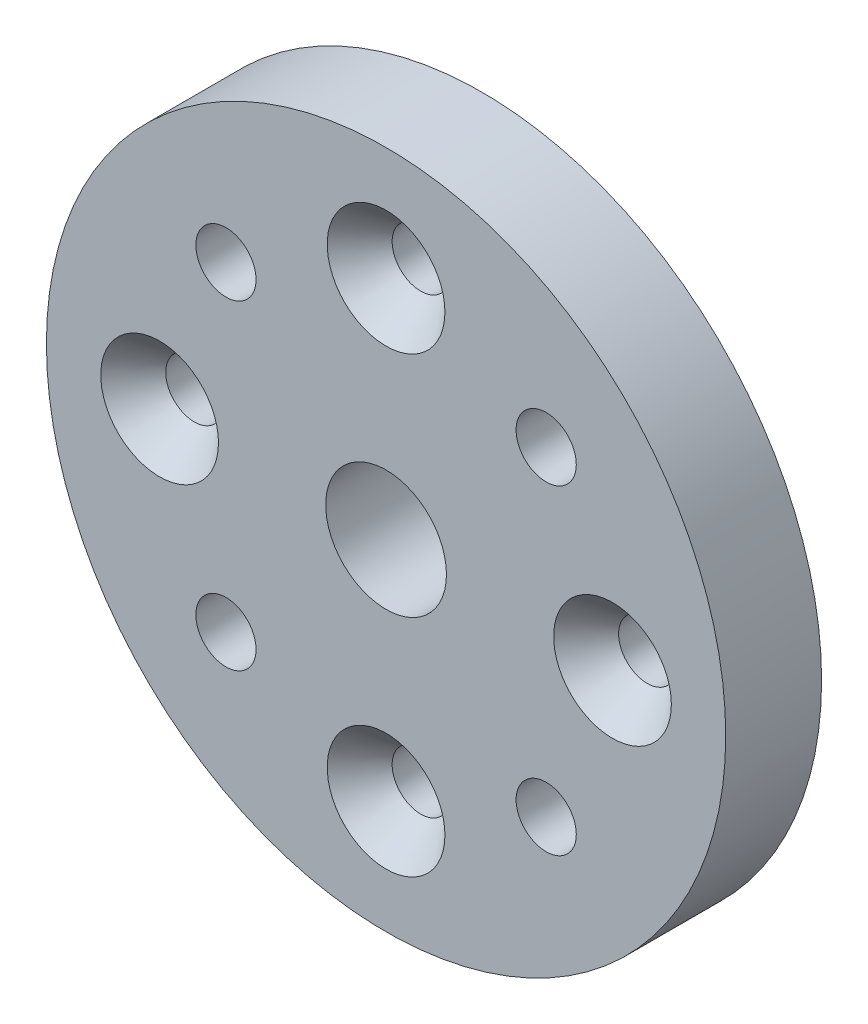
ISO-10303-21;
HEADER;
FILE_DESCRIPTION(('STEP AP214'),'2;1');
FILE_NAME('part.step','',(''),(''),'','','');
FILE_SCHEMA(('AUTOMOTIVE_DESIGN { 1 0 10303 214 1 1 1 1 }'));
ENDSEC;
DATA;
#1=APPLICATION_CONTEXT('core data for automotive mechanical design processes');
#2=APPLICATION_PROTOCOL_DEFINITION('international standard','automotive_design',2000,#1);
#3=PRODUCT_CONTEXT('',#1,'mechanical');
#4=PRODUCT('Part','Part','',(#3));
#5=PRODUCT_RELATED_PRODUCT_CATEGORY('part','',(#4));
#6=PRODUCT_DEFINITION_FORMATION('','',#4);
#7=PRODUCT_DEFINITION_CONTEXT('part definition',#1,'design');
#8=PRODUCT_DEFINITION('design','',#6,#7);
#9=PRODUCT_DEFINITION_SHAPE('','',#8);
#10=(LENGTH_UNIT() NAMED_UNIT(*) SI_UNIT(.MILLI.,.METRE.));
#11=(NAMED_UNIT(*) PLANE_ANGLE_UNIT() SI_UNIT($,.RADIAN.));
#12=(NAMED_UNIT(*) SI_UNIT($,.STERADIAN.) SOLID_ANGLE_UNIT());
#13=UNCERTAINTY_MEASURE_WITH_UNIT(LENGTH_MEASURE(1.E-05),#10,'distance_accuracy_value','');
#14=(GEOMETRIC_REPRESENTATION_CONTEXT(3) GLOBAL_UNCERTAINTY_ASSIGNED_CONTEXT((#13)) GLOBAL_UNIT_ASSIGNED_CONTEXT((#10,
#11,#12)) REPRESENTATION_CONTEXT('',''));
#15=CARTESIAN_POINT('',(0.,0.,0.));
#16=DIRECTION('',(0.,0.,1.));
#17=DIRECTION('',(1.,0.,0.));
#18=AXIS2_PLACEMENT_3D('',#15,#16,#17);
#19=CARTESIAN_POINT('',(0.,0.,6.35));
#20=DIRECTION('',(0.,0.,1.));
#21=DIRECTION('',(1.,0.,0.));
#22=AXIS2_PLACEMENT_3D('',#19,#20,#21);
#23=PLANE('',#22);
#24=CARTESIAN_POINT('',(3.48781665394082E-13,-15.0000000000002,6.35));
#25=DIRECTION('',(0.,0.,1.));
#26=DIRECTION('',(1.,0.,0.));
#27=AXIS2_PLACEMENT_3D('',#24,#25,#26);
#28=CIRCLE('',#27,3.8989000000297);
#29=CARTESIAN_POINT('',(3.89890000003005,-15.0000000000002,6.35));
#30=VERTEX_POINT('',#29);
#31=EDGE_CURVE('E48',#30,#30,#28,.F.);
#32=ORIENTED_EDGE('',*,*,#31,.T.);
#33=EDGE_LOOP('',(#32));
#34=FACE_BOUND('',#33,.T.);
#35=CARTESIAN_POINT('',(-15.,1.57116660247941E-13,6.35));
#36=DIRECTION('',(0.,0.,1.));
#37=DIRECTION('',(1.,0.,0.));
#38=AXIS2_PLACEMENT_3D('',#35,#36,#37);
#39=CIRCLE('',#38,3.8989000000297);
#40=CARTESIAN_POINT('',(-11.1010999999703,1.57116660247941E-13,6.35));
#41=VERTEX_POINT('',#40);
#42=EDGE_CURVE('E53',#41,#41,#39,.F.);
#43=ORIENTED_EDGE('',*,*,#42,.T.);
#44=EDGE_LOOP('',(#43));
#45=FACE_BOUND('',#44,.T.);
#46=CARTESIAN_POINT('',(0.,15.,6.35));
#47=DIRECTION('',(0.,0.,1.));
#48=DIRECTION('',(1.,0.,0.));
#49=AXIS2_PLACEMENT_3D('',#46,#47,#48);
#50=CIRCLE('',#49,3.8989000000297);
#51=CARTESIAN_POINT('',(3.8989000000297,15.,6.35));
#52=VERTEX_POINT('',#51);
#53=EDGE_CURVE('E56',#52,#52,#50,.F.);
#54=ORIENTED_EDGE('',*,*,#53,.T.);
#55=EDGE_LOOP('',(#54));
#56=FACE_BOUND('',#55,.T.);
#57=CARTESIAN_POINT('',(15.,0.,6.35));
#58=DIRECTION('',(0.,0.,1.));
#59=DIRECTION('',(1.,0.,0.));
#60=AXIS2_PLACEMENT_3D('',#57,#58,#59);
#61=CIRCLE('',#60,3.89890000002971);
#62=CARTESIAN_POINT('',(18.8989000000297,0.,6.35));
#63=VERTEX_POINT('',#62);
#64=EDGE_CURVE('E59',#63,#63,#61,.F.);
#65=ORIENTED_EDGE('',*,*,#64,.T.);
#66=EDGE_LOOP('',(#65));
#67=FACE_BOUND('',#66,.T.);
#68=CARTESIAN_POINT('',(0.,0.,6.35));
#69=DIRECTION('',(0.,0.,1.));
#70=DIRECTION('',(1.,0.,0.));
#71=AXIS2_PLACEMENT_3D('',#68,#69,#70);
#72=CIRCLE('',#71,22.5);
#73=CARTESIAN_POINT('',(22.5,0.,6.35));
#74=VERTEX_POINT('',#73);
#75=EDGE_CURVE('E65',#74,#74,#72,.T.);
#76=ORIENTED_EDGE('',*,*,#75,.T.);
#77=EDGE_LOOP('',(#76));
#78=FACE_BOUND('',#77,.T.);
#79=CARTESIAN_POINT('',(0.,0.,6.35));
#80=DIRECTION('',(0.,0.,1.));
#81=DIRECTION('',(1.,0.,0.));
#82=AXIS2_PLACEMENT_3D('',#79,#80,#81);
#83=CIRCLE('',#82,4.);
#84=CARTESIAN_POINT('',(4.,0.,6.35));
#85=VERTEX_POINT('',#84);
#86=EDGE_CURVE('E69',#85,#85,#83,.T.);
#87=ORIENTED_EDGE('',*,*,#86,.F.);
#88=EDGE_LOOP('',(#87));
#89=FACE_BOUND('',#88,.T.);
#90=CARTESIAN_POINT('',(10.6066017177982,10.6066017177982,6.35));
#91=DIRECTION('',(0.,0.,1.));
#92=DIRECTION('',(1.,0.,0.));
#93=AXIS2_PLACEMENT_3D('',#90,#91,#92);
#94=CIRCLE('',#93,1.9939);
#95=CARTESIAN_POINT('',(12.6005017177982,10.6066017177982,6.35));
#96=VERTEX_POINT('',#95);
#97=EDGE_CURVE('E80',#96,#96,#94,.T.);
#98=ORIENTED_EDGE('',*,*,#97,.F.);
#99=EDGE_LOOP('',(#98));
#100=FACE_BOUND('',#99,.T.);
#101=CARTESIAN_POINT('',(10.6066017177982,-10.6066017177983,6.35));
#102=DIRECTION('',(0.,0.,1.));
#103=DIRECTION('',(1.,0.,0.));
#104=AXIS2_PLACEMENT_3D('',#101,#102,#103);
#105=CIRCLE('',#104,1.9939);
#106=CARTESIAN_POINT('',(12.6005017177982,-10.6066017177983,6.35));
#107=VERTEX_POINT('',#106);
#108=EDGE_CURVE('E89',#107,#107,#105,.T.);
#109=ORIENTED_EDGE('',*,*,#108,.F.);
#110=EDGE_LOOP('',(#109));
#111=FACE_BOUND('',#110,.T.);
#112=CARTESIAN_POINT('',(-10.6066017177979,-10.6066017177983,6.35));
#113=DIRECTION('',(0.,0.,1.));
#114=DIRECTION('',(1.,0.,0.));
#115=AXIS2_PLACEMENT_3D('',#112,#113,#114);
#116=CIRCLE('',#115,1.9939);
#117=CARTESIAN_POINT('',(-8.61270171779788,-10.6066017177983,6.35));
#118=VERTEX_POINT('',#117);
#119=EDGE_CURVE('E98',#118,#118,#116,.T.);
#120=ORIENTED_EDGE('',*,*,#119,.F.);
#121=EDGE_LOOP('',(#120));
#122=FACE_BOUND('',#121,.T.);
#123=CARTESIAN_POINT('',(-10.6066017177981,10.6066017177983,6.35));
#124=DIRECTION('',(0.,0.,1.));
#125=DIRECTION('',(1.,0.,0.));
#126=AXIS2_PLACEMENT_3D('',#123,#124,#125);
#127=CIRCLE('',#126,1.9939);
#128=CARTESIAN_POINT('',(-8.61270171779808,10.6066017177983,6.35));
#129=VERTEX_POINT('',#128);
#130=EDGE_CURVE('E107',#129,#129,#127,.T.);
#131=ORIENTED_EDGE('',*,*,#130,.F.);
#132=EDGE_LOOP('',(#131));
#133=FACE_BOUND('',#132,.T.);
#134=ADVANCED_FACE('F33',(#34,#45,#56,#67,#78,#89,#100,#111,#122,#133),#23,.T.);
#135=CARTESIAN_POINT('',(0.,0.,0.));
#136=DIRECTION('',(0.,0.,1.));
#137=DIRECTION('',(1.,0.,0.));
#138=AXIS2_PLACEMENT_3D('',#135,#136,#137);
#139=PLANE('',#138);
#140=CARTESIAN_POINT('',(0.,0.,0.));
#141=DIRECTION('',(0.,0.,1.));
#142=DIRECTION('',(1.,0.,0.));
#143=AXIS2_PLACEMENT_3D('',#140,#141,#142);
#144=CIRCLE('',#143,22.5);
#145=CARTESIAN_POINT('',(22.5,0.,0.));
#146=VERTEX_POINT('',#145);
#147=EDGE_CURVE('E66',#146,#146,#144,.T.);
#148=ORIENTED_EDGE('',*,*,#147,.F.);
#149=EDGE_LOOP('',(#148));
#150=FACE_BOUND('',#149,.T.);
#151=CARTESIAN_POINT('',(0.,0.,0.));
#152=DIRECTION('',(0.,0.,1.));
#153=DIRECTION('',(1.,0.,0.));
#154=AXIS2_PLACEMENT_3D('',#151,#152,#153);
#155=CIRCLE('',#154,4.);
#156=CARTESIAN_POINT('',(4.,0.,0.));
#157=VERTEX_POINT('',#156);
#158=EDGE_CURVE('E72',#157,#157,#155,.T.);
#159=ORIENTED_EDGE('',*,*,#158,.T.);
#160=EDGE_LOOP('',(#159));
#161=FACE_BOUND('',#160,.T.);
#162=CARTESIAN_POINT('',(0.,15.,0.));
#163=DIRECTION('',(0.,0.,1.));
#164=DIRECTION('',(1.,0.,0.));
#165=AXIS2_PLACEMENT_3D('',#162,#163,#164);
#166=CIRCLE('',#165,1.89865);
#167=CARTESIAN_POINT('',(1.89865,15.,0.));
#168=VERTEX_POINT('',#167);
#169=EDGE_CURVE('E75',#168,#168,#166,.T.);
#170=ORIENTED_EDGE('',*,*,#169,.T.);
#171=EDGE_LOOP('',(#170));
#172=FACE_BOUND('',#171,.T.);
#173=CARTESIAN_POINT('',(10.6066017177982,10.6066017177982,0.));
#174=DIRECTION('',(0.,0.,1.));
#175=DIRECTION('',(1.,0.,0.));
#176=AXIS2_PLACEMENT_3D('',#173,#174,#175);
#177=CIRCLE('',#176,1.9939);
#178=CARTESIAN_POINT('',(12.6005017177982,10.6066017177982,0.));
#179=VERTEX_POINT('',#178);
#180=EDGE_CURVE('E81',#179,#179,#177,.T.);
#181=ORIENTED_EDGE('',*,*,#180,.T.);
#182=EDGE_LOOP('',(#181));
#183=FACE_BOUND('',#182,.T.);
#184=CARTESIAN_POINT('',(15.,0.,0.));
#185=DIRECTION('',(0.,0.,1.));
#186=DIRECTION('',(1.,0.,0.));
#187=AXIS2_PLACEMENT_3D('',#184,#185,#186);
#188=CIRCLE('',#187,1.89865);
#189=CARTESIAN_POINT('',(16.89865,0.,0.));
#190=VERTEX_POINT('',#189);
#191=EDGE_CURVE('E84',#190,#190,#188,.T.);
#192=ORIENTED_EDGE('',*,*,#191,.T.);
#193=EDGE_LOOP('',(#192));
#194=FACE_BOUND('',#193,.T.);
#195=CARTESIAN_POINT('',(10.6066017177982,-10.6066017177983,0.));
#196=DIRECTION('',(0.,0.,1.));
#197=DIRECTION('',(1.,0.,0.));
#198=AXIS2_PLACEMENT_3D('',#195,#196,#197);
#199=CIRCLE('',#198,1.9939);
#200=CARTESIAN_POINT('',(12.6005017177982,-10.6066017177983,0.));
#201=VERTEX_POINT('',#200);
#202=EDGE_CURVE('E90',#201,#201,#199,.T.);
#203=ORIENTED_EDGE('',*,*,#202,.T.);
#204=EDGE_LOOP('',(#203));
#205=FACE_BOUND('',#204,.T.);
#206=CARTESIAN_POINT('',(3.48781665394082E-13,-15.0000000000002,0.));
#207=DIRECTION('',(0.,0.,1.));
#208=DIRECTION('',(1.,0.,0.));
#209=AXIS2_PLACEMENT_3D('',#206,#207,#208);
#210=CIRCLE('',#209,1.89865);
#211=CARTESIAN_POINT('',(1.89865000000035,-15.0000000000002,0.));
#212=VERTEX_POINT('',#211);
#213=EDGE_CURVE('E93',#212,#212,#210,.T.);
#214=ORIENTED_EDGE('',*,*,#213,.T.);
#215=EDGE_LOOP('',(#214));
#216=FACE_BOUND('',#215,.T.);
#217=CARTESIAN_POINT('',(-10.6066017177979,-10.6066017177983,0.));
#218=DIRECTION('',(0.,0.,1.));
#219=DIRECTION('',(1.,0.,0.));
#220=AXIS2_PLACEMENT_3D('',#217,#218,#219);
#221=CIRCLE('',#220,1.9939);
#222=CARTESIAN_POINT('',(-8.61270171779788,-10.6066017177983,0.));
#223=VERTEX_POINT('',#222);
#224=EDGE_CURVE('E99',#223,#223,#221,.T.);
#225=ORIENTED_EDGE('',*,*,#224,.T.);
#226=EDGE_LOOP('',(#225));
#227=FACE_BOUND('',#226,.T.);
#228=CARTESIAN_POINT('',(-15.,1.57116660247941E-13,0.));
#229=DIRECTION('',(0.,0.,1.));
#230=DIRECTION('',(1.,0.,0.));
#231=AXIS2_PLACEMENT_3D('',#228,#229,#230);
#232=CIRCLE('',#231,1.89865);
#233=CARTESIAN_POINT('',(-13.10135,1.57116660247941E-13,0.));
#234=VERTEX_POINT('',#233);
#235=EDGE_CURVE('E102',#234,#234,#232,.T.);
#236=ORIENTED_EDGE('',*,*,#235,.T.);
#237=EDGE_LOOP('',(#236));
#238=FACE_BOUND('',#237,.T.);
#239=CARTESIAN_POINT('',(-10.6066017177981,10.6066017177983,0.));
#240=DIRECTION('',(0.,0.,1.));
#241=DIRECTION('',(1.,0.,0.));
#242=AXIS2_PLACEMENT_3D('',#239,#240,#241);
#243=CIRCLE('',#242,1.9939);
#244=CARTESIAN_POINT('',(-8.61270171779808,10.6066017177983,0.));
#245=VERTEX_POINT('',#244);
#246=EDGE_CURVE('E108',#245,#245,#243,.T.);
#247=ORIENTED_EDGE('',*,*,#246,.T.);
#248=EDGE_LOOP('',(#247));
#249=FACE_BOUND('',#248,.T.);
#250=ADVANCED_FACE('F118',(#150,#161,#172,#183,#194,#205,#216,#227,#238,#249),#139,.F.);
#251=CARTESIAN_POINT('',(0.,0.,6.35));
#252=DIRECTION('',(0.,0.,-1.));
#253=DIRECTION('',(-1.,0.,0.));
#254=AXIS2_PLACEMENT_3D('',#251,#252,#253);
#255=CYLINDRICAL_SURFACE('',#254,22.5);
#256=ORIENTED_EDGE('',*,*,#75,.F.);
#257=EDGE_LOOP('',(#256));
#258=FACE_BOUND('',#257,.T.);
#259=ORIENTED_EDGE('',*,*,#147,.T.);
#260=EDGE_LOOP('',(#259));
#261=FACE_BOUND('',#260,.T.);
#262=ADVANCED_FACE('F124',(#258,#261),#255,.T.);
#263=CARTESIAN_POINT('',(0.,0.,6.35));
#264=DIRECTION('',(0.,0.,-1.));
#265=DIRECTION('',(-1.,0.,0.));
#266=AXIS2_PLACEMENT_3D('',#263,#264,#265);
#267=CYLINDRICAL_SURFACE('',#266,4.);
#268=ORIENTED_EDGE('',*,*,#86,.T.);
#269=EDGE_LOOP('',(#268));
#270=FACE_BOUND('',#269,.T.);
#271=ORIENTED_EDGE('',*,*,#158,.F.);
#272=EDGE_LOOP('',(#271));
#273=FACE_BOUND('',#272,.T.);
#274=ADVANCED_FACE('F129',(#270,#273),#267,.F.);
#275=CARTESIAN_POINT('',(0.,15.,6.35));
#276=DIRECTION('',(0.,0.,-1.));
#277=DIRECTION('',(-1.,0.,0.));
#278=AXIS2_PLACEMENT_3D('',#275,#276,#277);
#279=CYLINDRICAL_SURFACE('',#278,1.89865);
#280=CARTESIAN_POINT('',(0.,15.,4.048975593422));
#281=DIRECTION('',(0.,0.,1.));
#282=DIRECTION('',(1.,0.,0.));
#283=AXIS2_PLACEMENT_3D('',#280,#281,#282);
#284=CIRCLE('',#283,1.89865);
#285=CARTESIAN_POINT('',(1.89865,15.,4.048975593422));
#286=VERTEX_POINT('',#285);
#287=EDGE_CURVE('E40',#286,#286,#284,.T.);
#288=ORIENTED_EDGE('',*,*,#287,.T.);
#289=EDGE_LOOP('',(#288));
#290=FACE_BOUND('',#289,.T.);
#291=ORIENTED_EDGE('',*,*,#169,.F.);
#292=EDGE_LOOP('',(#291));
#293=FACE_BOUND('',#292,.T.);
#294=ADVANCED_FACE('F197',(#290,#293),#279,.F.);
#295=CARTESIAN_POINT('',(10.6066017177982,10.6066017177982,6.35));
#296=DIRECTION('',(0.,0.,-1.));
#297=DIRECTION('',(-1.,0.,0.));
#298=AXIS2_PLACEMENT_3D('',#295,#296,#297);
#299=CYLINDRICAL_SURFACE('',#298,1.9939);
#300=ORIENTED_EDGE('',*,*,#97,.T.);
#301=EDGE_LOOP('',(#300));
#302=FACE_BOUND('',#301,.T.);
#303=ORIENTED_EDGE('',*,*,#180,.F.);
#304=EDGE_LOOP('',(#303));
#305=FACE_BOUND('',#304,.T.);
#306=ADVANCED_FACE('F195',(#302,#305),#299,.F.);
#307=CARTESIAN_POINT('',(15.,0.,6.35));
#308=DIRECTION('',(0.,0.,-1.));
#309=DIRECTION('',(-1.,0.,0.));
#310=AXIS2_PLACEMENT_3D('',#307,#308,#309);
#311=CYLINDRICAL_SURFACE('',#310,1.89865);
#312=CARTESIAN_POINT('',(15.,0.,4.04897559342199));
#313=DIRECTION('',(0.,0.,1.));
#314=DIRECTION('',(1.,0.,0.));
#315=AXIS2_PLACEMENT_3D('',#312,#313,#314);
#316=CIRCLE('',#315,1.89865);
#317=CARTESIAN_POINT('',(16.89865,0.,4.04897559342199));
#318=VERTEX_POINT('',#317);
#319=EDGE_CURVE('E10',#318,#318,#316,.T.);
#320=ORIENTED_EDGE('',*,*,#319,.T.);
#321=EDGE_LOOP('',(#320));
#322=FACE_BOUND('',#321,.T.);
#323=ORIENTED_EDGE('',*,*,#191,.F.);
#324=EDGE_LOOP('',(#323));
#325=FACE_BOUND('',#324,.T.);
#326=ADVANCED_FACE('F191',(#322,#325),#311,.F.);
#327=CARTESIAN_POINT('',(10.6066017177982,-10.6066017177983,6.35));
#328=DIRECTION('',(0.,0.,-1.));
#329=DIRECTION('',(-1.,0.,0.));
#330=AXIS2_PLACEMENT_3D('',#327,#328,#329);
#331=CYLINDRICAL_SURFACE('',#330,1.9939);
#332=ORIENTED_EDGE('',*,*,#108,.T.);
#333=EDGE_LOOP('',(#332));
#334=FACE_BOUND('',#333,.T.);
#335=ORIENTED_EDGE('',*,*,#202,.F.);
#336=EDGE_LOOP('',(#335));
#337=FACE_BOUND('',#336,.T.);
#338=ADVANCED_FACE('F187',(#334,#337),#331,.F.);
#339=CARTESIAN_POINT('',(3.48781665394082E-13,-15.0000000000002,6.35));
#340=DIRECTION('',(0.,0.,-1.));
#341=DIRECTION('',(-1.,0.,0.));
#342=AXIS2_PLACEMENT_3D('',#339,#340,#341);
#343=CYLINDRICAL_SURFACE('',#342,1.89865);
#344=CARTESIAN_POINT('',(3.48781665394082E-13,-15.0000000000002,4.048975593422));
#345=DIRECTION('',(0.,0.,1.));
#346=DIRECTION('',(1.,0.,0.));
#347=AXIS2_PLACEMENT_3D('',#344,#345,#346);
#348=CIRCLE('',#347,1.89865);
#349=CARTESIAN_POINT('',(1.89865000000035,-15.0000000000002,4.048975593422));
#350=VERTEX_POINT('',#349);
#351=EDGE_CURVE('E62',#350,#350,#348,.T.);
#352=ORIENTED_EDGE('',*,*,#351,.T.);
#353=EDGE_LOOP('',(#352));
#354=FACE_BOUND('',#353,.T.);
#355=ORIENTED_EDGE('',*,*,#213,.F.);
#356=EDGE_LOOP('',(#355));
#357=FACE_BOUND('',#356,.T.);
#358=ADVANCED_FACE('F169',(#354,#357),#343,.F.);
#359=CARTESIAN_POINT('',(-10.6066017177979,-10.6066017177983,6.35));
#360=DIRECTION('',(0.,0.,-1.));
#361=DIRECTION('',(-1.,0.,0.));
#362=AXIS2_PLACEMENT_3D('',#359,#360,#361);
#363=CYLINDRICAL_SURFACE('',#362,1.9939);
#364=ORIENTED_EDGE('',*,*,#119,.T.);
#365=EDGE_LOOP('',(#364));
#366=FACE_BOUND('',#365,.T.);
#367=ORIENTED_EDGE('',*,*,#224,.F.);
#368=EDGE_LOOP('',(#367));
#369=FACE_BOUND('',#368,.T.);
#370=ADVANCED_FACE('F165',(#366,#369),#363,.F.);
#371=CARTESIAN_POINT('',(-15.,1.57116660247941E-13,6.35));
#372=DIRECTION('',(0.,0.,-1.));
#373=DIRECTION('',(-1.,0.,0.));
#374=AXIS2_PLACEMENT_3D('',#371,#372,#373);
#375=CYLINDRICAL_SURFACE('',#374,1.89865);
#376=CARTESIAN_POINT('',(-15.,1.57116660247941E-13,4.048975593422));
#377=DIRECTION('',(0.,0.,1.));
#378=DIRECTION('',(1.,0.,0.));
#379=AXIS2_PLACEMENT_3D('',#376,#377,#378);
#380=CIRCLE('',#379,1.89865);
#381=CARTESIAN_POINT('',(-13.10135,1.57116660247941E-13,4.048975593422));
#382=VERTEX_POINT('',#381);
#383=EDGE_CURVE('E44',#382,#382,#380,.T.);
#384=ORIENTED_EDGE('',*,*,#383,.T.);
#385=EDGE_LOOP('',(#384));
#386=FACE_BOUND('',#385,.T.);
#387=ORIENTED_EDGE('',*,*,#235,.F.);
#388=EDGE_LOOP('',(#387));
#389=FACE_BOUND('',#388,.T.);
#390=ADVANCED_FACE('F168',(#386,#389),#375,.F.);
#391=CARTESIAN_POINT('',(-10.6066017177981,10.6066017177983,6.35));
#392=DIRECTION('',(0.,0.,-1.));
#393=DIRECTION('',(-1.,0.,0.));
#394=AXIS2_PLACEMENT_3D('',#391,#392,#393);
#395=CYLINDRICAL_SURFACE('',#394,1.9939);
#396=ORIENTED_EDGE('',*,*,#130,.T.);
#397=EDGE_LOOP('',(#396));
#398=FACE_BOUND('',#397,.T.);
#399=ORIENTED_EDGE('',*,*,#246,.F.);
#400=EDGE_LOOP('',(#399));
#401=FACE_BOUND('',#400,.T.);
#402=ADVANCED_FACE('F114',(#398,#401),#395,.F.);
#403=CARTESIAN_POINT('',(3.48781665394082E-13,-15.0000000000002,4.048975593422));
#404=DIRECTION('',(0.,0.,1.));
#405=DIRECTION('',(1.,0.,0.));
#406=AXIS2_PLACEMENT_3D('',#403,#404,#405);
#407=CONICAL_SURFACE('',#406,1.89865,0.715584993317673);
#408=ORIENTED_EDGE('',*,*,#31,.F.);
#409=EDGE_LOOP('',(#408));
#410=FACE_BOUND('',#409,.T.);
#411=ORIENTED_EDGE('',*,*,#351,.F.);
#412=EDGE_LOOP('',(#411));
#413=FACE_BOUND('',#412,.T.);
#414=ADVANCED_FACE('F135',(#410,#413),#407,.F.);
#415=CARTESIAN_POINT('',(-15.,1.57116660247941E-13,4.048975593422));
#416=DIRECTION('',(0.,0.,1.));
#417=DIRECTION('',(1.,0.,0.));
#418=AXIS2_PLACEMENT_3D('',#415,#416,#417);
#419=CONICAL_SURFACE('',#418,1.89865,0.715584993317674);
#420=ORIENTED_EDGE('',*,*,#42,.F.);
#421=EDGE_LOOP('',(#420));
#422=FACE_BOUND('',#421,.T.);
#423=ORIENTED_EDGE('',*,*,#383,.F.);
#424=EDGE_LOOP('',(#423));
#425=FACE_BOUND('',#424,.T.);
#426=ADVANCED_FACE('F138',(#422,#425),#419,.F.);
#427=CARTESIAN_POINT('',(0.,15.,4.048975593422));
#428=DIRECTION('',(0.,0.,1.));
#429=DIRECTION('',(1.,0.,0.));
#430=AXIS2_PLACEMENT_3D('',#427,#428,#429);
#431=CONICAL_SURFACE('',#430,1.89865,0.715584993317673);
#432=ORIENTED_EDGE('',*,*,#53,.F.);
#433=EDGE_LOOP('',(#432));
#434=FACE_BOUND('',#433,.T.);
#435=ORIENTED_EDGE('',*,*,#287,.F.);
#436=EDGE_LOOP('',(#435));
#437=FACE_BOUND('',#436,.T.);
#438=ADVANCED_FACE('F141',(#434,#437),#431,.F.);
#439=CARTESIAN_POINT('',(15.,0.,4.04897559342199));
#440=DIRECTION('',(0.,0.,1.));
#441=DIRECTION('',(1.,0.,0.));
#442=AXIS2_PLACEMENT_3D('',#439,#440,#441);
#443=CONICAL_SURFACE('',#442,1.89865,0.715584993317673);
#444=ORIENTED_EDGE('',*,*,#64,.F.);
#445=EDGE_LOOP('',(#444));
#446=FACE_BOUND('',#445,.T.);
#447=ORIENTED_EDGE('',*,*,#319,.F.);
#448=EDGE_LOOP('',(#447));
#449=FACE_BOUND('',#448,.T.);
#450=ADVANCED_FACE('F35',(#446,#449),#443,.F.);
#451=CLOSED_SHELL('',(#134,#250,#262,#274,#294,#306,#326,#338,#358,#370,#390,#402,#414,#426,
#438,#450));
#452=MANIFOLD_SOLID_BREP('B2',#451);
#453=ADVANCED_BREP_SHAPE_REPRESENTATION('',(#18,#452),#14);
#454=SHAPE_DEFINITION_REPRESENTATION(#9,#453);
ENDSEC;
END-ISO-10303-21;
